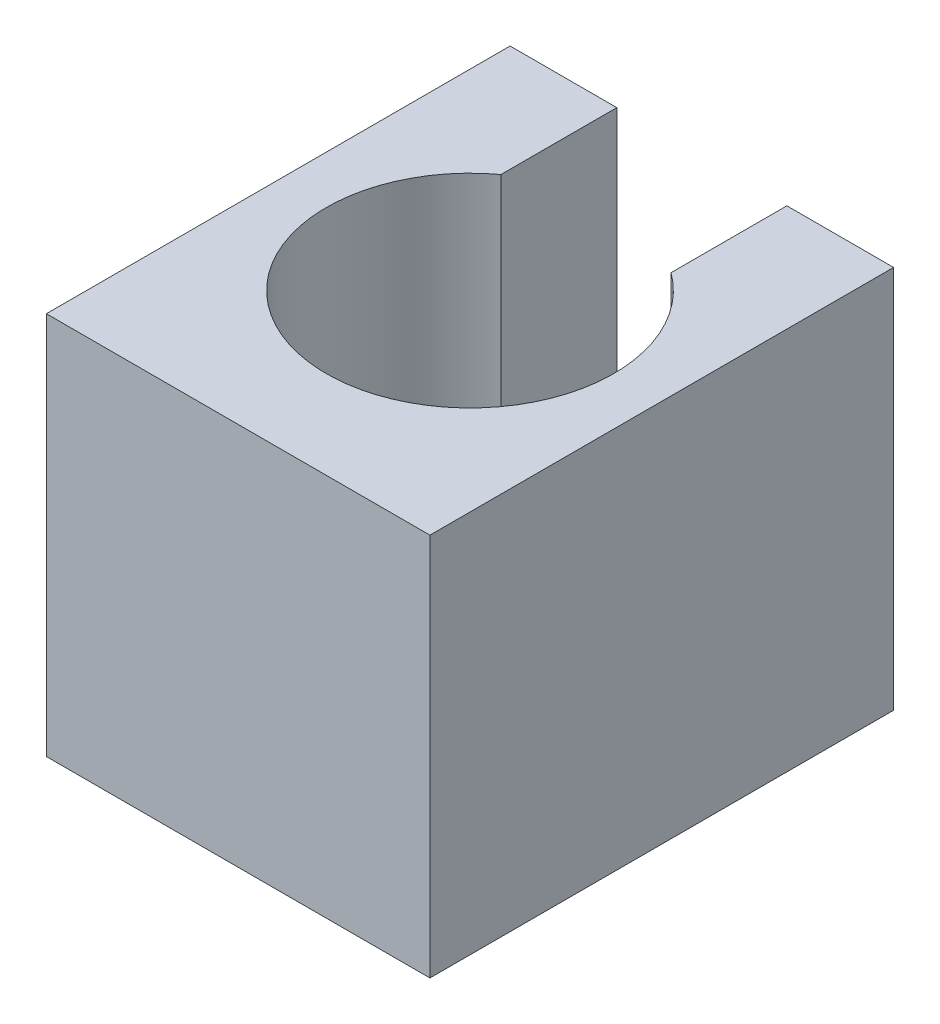
ISO-10303-21;
HEADER;
FILE_DESCRIPTION(('STEP AP214'),'2;1');
FILE_NAME('part.step','',(''),(''),'','','');
FILE_SCHEMA(('AUTOMOTIVE_DESIGN { 1 0 10303 214 1 1 1 1 }'));
ENDSEC;
DATA;
#1=APPLICATION_CONTEXT('core data for automotive mechanical design processes');
#2=APPLICATION_PROTOCOL_DEFINITION('international standard','automotive_design',2000,#1);
#3=PRODUCT_CONTEXT('',#1,'mechanical');
#4=PRODUCT('Part','Part','',(#3));
#5=PRODUCT_RELATED_PRODUCT_CATEGORY('part','',(#4));
#6=PRODUCT_DEFINITION_FORMATION('','',#4);
#7=PRODUCT_DEFINITION_CONTEXT('part definition',#1,'design');
#8=PRODUCT_DEFINITION('design','',#6,#7);
#9=PRODUCT_DEFINITION_SHAPE('','',#8);
#10=(LENGTH_UNIT() NAMED_UNIT(*) SI_UNIT(.MILLI.,.METRE.));
#11=(NAMED_UNIT(*) PLANE_ANGLE_UNIT() SI_UNIT($,.RADIAN.));
#12=(NAMED_UNIT(*) SI_UNIT($,.STERADIAN.) SOLID_ANGLE_UNIT());
#13=UNCERTAINTY_MEASURE_WITH_UNIT(LENGTH_MEASURE(1.E-05),#10,'distance_accuracy_value','');
#14=(GEOMETRIC_REPRESENTATION_CONTEXT(3) GLOBAL_UNCERTAINTY_ASSIGNED_CONTEXT((#13)) GLOBAL_UNIT_ASSIGNED_CONTEXT((#10,
#11,#12)) REPRESENTATION_CONTEXT('',''));
#15=CARTESIAN_POINT('',(0.,0.,0.));
#16=DIRECTION('',(0.,0.,1.));
#17=DIRECTION('',(1.,0.,0.));
#18=AXIS2_PLACEMENT_3D('',#15,#16,#17);
#19=CARTESIAN_POINT('',(3.,6.,-3.62704662847209));
#20=DIRECTION('',(-1.,0.,0.));
#21=DIRECTION('',(0.,0.,1.));
#22=AXIS2_PLACEMENT_3D('',#19,#20,#21);
#23=PLANE('',#22);
#24=DIRECTION('',(0.,0.,-1.));
#25=VECTOR('',#24,1.);
#26=CARTESIAN_POINT('',(3.,0.,-3.62704662847209));
#27=LINE('',#26,#25);
#28=CARTESIAN_POINT('',(3.,0.,3.62704662847209));
#29=VERTEX_POINT('',#28);
#30=CARTESIAN_POINT('',(3.,0.,-3.62704662847209));
#31=VERTEX_POINT('',#30);
#32=EDGE_CURVE('E131',#29,#31,#27,.T.);
#33=ORIENTED_EDGE('',*,*,#32,.T.);
#34=DIRECTION('',(0.,-1.,0.));
#35=VECTOR('',#34,1.);
#36=CARTESIAN_POINT('',(3.,6.,-3.62704662847209));
#37=LINE('',#36,#35);
#38=CARTESIAN_POINT('',(3.,6.,-3.62704662847209));
#39=VERTEX_POINT('',#38);
#40=EDGE_CURVE('E11',#39,#31,#37,.T.);
#41=ORIENTED_EDGE('',*,*,#40,.F.);
#42=DIRECTION('',(0.,0.,-1.));
#43=VECTOR('',#42,1.);
#44=CARTESIAN_POINT('',(3.,6.,-3.62704662847209));
#45=LINE('',#44,#43);
#46=CARTESIAN_POINT('',(3.,6.,3.62704662847209));
#47=VERTEX_POINT('',#46);
#48=EDGE_CURVE('E145',#47,#39,#45,.T.);
#49=ORIENTED_EDGE('',*,*,#48,.F.);
#50=DIRECTION('',(0.,-1.,0.));
#51=VECTOR('',#50,1.);
#52=CARTESIAN_POINT('',(3.,6.,3.62704662847209));
#53=LINE('',#52,#51);
#54=EDGE_CURVE('E127',#47,#29,#53,.T.);
#55=ORIENTED_EDGE('',*,*,#54,.T.);
#56=EDGE_LOOP('',(#33,#41,#49,#55));
#57=FACE_BOUND('',#56,.T.);
#58=ADVANCED_FACE('F35',(#57),#23,.F.);
#59=CARTESIAN_POINT('',(1.33027332112443,6.,-3.62704662847209));
#60=DIRECTION('',(0.,0.,1.));
#61=DIRECTION('',(1.,0.,0.));
#62=AXIS2_PLACEMENT_3D('',#59,#60,#61);
#63=PLANE('',#62);
#64=DIRECTION('',(-1.,0.,0.));
#65=VECTOR('',#64,1.);
#66=CARTESIAN_POINT('',(1.33027332112443,0.,-3.62704662847209));
#67=LINE('',#66,#65);
#68=CARTESIAN_POINT('',(1.33027332112443,0.,-3.62704662847209));
#69=VERTEX_POINT('',#68);
#70=EDGE_CURVE('E134',#31,#69,#67,.T.);
#71=ORIENTED_EDGE('',*,*,#70,.T.);
#72=DIRECTION('',(0.,-1.,0.));
#73=VECTOR('',#72,1.);
#74=CARTESIAN_POINT('',(1.33027332112443,6.,-3.62704662847209));
#75=LINE('',#74,#73);
#76=CARTESIAN_POINT('',(1.33027332112443,6.,-3.62704662847209));
#77=VERTEX_POINT('',#76);
#78=EDGE_CURVE('E43',#77,#69,#75,.T.);
#79=ORIENTED_EDGE('',*,*,#78,.F.);
#80=DIRECTION('',(-1.,0.,0.));
#81=VECTOR('',#80,1.);
#82=CARTESIAN_POINT('',(1.33027332112443,6.,-3.62704662847209));
#83=LINE('',#82,#81);
#84=EDGE_CURVE('E94',#39,#77,#83,.T.);
#85=ORIENTED_EDGE('',*,*,#84,.F.);
#86=ORIENTED_EDGE('',*,*,#40,.T.);
#87=EDGE_LOOP('',(#71,#79,#85,#86));
#88=FACE_BOUND('',#87,.T.);
#89=ADVANCED_FACE('F180',(#88),#63,.F.);
#90=CARTESIAN_POINT('',(1.33027332112443,6.,-3.62704662847209));
#91=DIRECTION('',(1.,0.,0.));
#92=DIRECTION('',(0.,0.,-1.));
#93=AXIS2_PLACEMENT_3D('',#90,#91,#92);
#94=PLANE('',#93);
#95=DIRECTION('',(0.,0.,1.));
#96=VECTOR('',#95,1.);
#97=CARTESIAN_POINT('',(1.33027332112443,0.,-3.62704662847209));
#98=LINE('',#97,#96);
#99=CARTESIAN_POINT('',(1.33027332112443,0.,-1.81462747998166));
#100=VERTEX_POINT('',#99);
#101=EDGE_CURVE('E136',#69,#100,#98,.T.);
#102=ORIENTED_EDGE('',*,*,#101,.T.);
#103=DIRECTION('',(0.,-1.,0.));
#104=VECTOR('',#103,1.);
#105=CARTESIAN_POINT('',(1.33027332112443,6.,-1.81462747998166));
#106=LINE('',#105,#104);
#107=CARTESIAN_POINT('',(1.33027332112443,6.,-1.81462747998166));
#108=VERTEX_POINT('',#107);
#109=EDGE_CURVE('E152',#108,#100,#106,.T.);
#110=ORIENTED_EDGE('',*,*,#109,.F.);
#111=DIRECTION('',(0.,0.,1.));
#112=VECTOR('',#111,1.);
#113=CARTESIAN_POINT('',(1.33027332112443,6.,-3.62704662847209));
#114=LINE('',#113,#112);
#115=EDGE_CURVE('E160',#77,#108,#114,.T.);
#116=ORIENTED_EDGE('',*,*,#115,.F.);
#117=ORIENTED_EDGE('',*,*,#78,.T.);
#118=EDGE_LOOP('',(#102,#110,#116,#117));
#119=FACE_BOUND('',#118,.T.);
#120=ADVANCED_FACE('F158',(#119),#94,.F.);
#121=CARTESIAN_POINT('',(0.,6.,0.));
#122=DIRECTION('',(0.,-1.,0.));
#123=DIRECTION('',(0.,0.,-1.));
#124=AXIS2_PLACEMENT_3D('',#121,#122,#123);
#125=CYLINDRICAL_SURFACE('',#124,2.25);
#126=CARTESIAN_POINT('',(0.,0.,0.));
#127=DIRECTION('',(0.,-1.,0.));
#128=DIRECTION('',(0.,0.,1.));
#129=AXIS2_PLACEMENT_3D('',#126,#127,#128);
#130=CIRCLE('',#129,2.25);
#131=CARTESIAN_POINT('',(-1.33027332112443,0.,-1.81462747998166));
#132=VERTEX_POINT('',#131);
#133=EDGE_CURVE('E138',#100,#132,#130,.T.);
#134=ORIENTED_EDGE('',*,*,#133,.T.);
#135=DIRECTION('',(0.,-1.,0.));
#136=VECTOR('',#135,1.);
#137=CARTESIAN_POINT('',(-1.33027332112443,6.,-1.81462747998166));
#138=LINE('',#137,#136);
#139=CARTESIAN_POINT('',(-1.33027332112443,6.,-1.81462747998166));
#140=VERTEX_POINT('',#139);
#141=EDGE_CURVE('E149',#140,#132,#138,.T.);
#142=ORIENTED_EDGE('',*,*,#141,.F.);
#143=CARTESIAN_POINT('',(0.,6.,0.));
#144=DIRECTION('',(0.,-1.,0.));
#145=DIRECTION('',(0.,0.,1.));
#146=AXIS2_PLACEMENT_3D('',#143,#144,#145);
#147=CIRCLE('',#146,2.25);
#148=EDGE_CURVE('E172',#108,#140,#147,.T.);
#149=ORIENTED_EDGE('',*,*,#148,.F.);
#150=ORIENTED_EDGE('',*,*,#109,.T.);
#151=EDGE_LOOP('',(#134,#142,#149,#150));
#152=FACE_BOUND('',#151,.T.);
#153=ADVANCED_FACE('F168',(#152),#125,.F.);
#154=CARTESIAN_POINT('',(-1.33027332112443,6.,-3.62704662847209));
#155=DIRECTION('',(-1.,0.,0.));
#156=DIRECTION('',(0.,0.,1.));
#157=AXIS2_PLACEMENT_3D('',#154,#155,#156);
#158=PLANE('',#157);
#159=DIRECTION('',(0.,0.,-1.));
#160=VECTOR('',#159,1.);
#161=CARTESIAN_POINT('',(-1.33027332112443,0.,-3.62704662847209));
#162=LINE('',#161,#160);
#163=CARTESIAN_POINT('',(-1.33027332112443,0.,-3.62704662847209));
#164=VERTEX_POINT('',#163);
#165=EDGE_CURVE('E140',#132,#164,#162,.T.);
#166=ORIENTED_EDGE('',*,*,#165,.T.);
#167=DIRECTION('',(0.,-1.,0.));
#168=VECTOR('',#167,1.);
#169=CARTESIAN_POINT('',(-1.33027332112443,6.,-3.62704662847209));
#170=LINE('',#169,#168);
#171=CARTESIAN_POINT('',(-1.33027332112443,6.,-3.62704662847209));
#172=VERTEX_POINT('',#171);
#173=EDGE_CURVE('E122',#172,#164,#170,.T.);
#174=ORIENTED_EDGE('',*,*,#173,.F.);
#175=DIRECTION('',(0.,0.,-1.));
#176=VECTOR('',#175,1.);
#177=CARTESIAN_POINT('',(-1.33027332112443,6.,-3.62704662847209));
#178=LINE('',#177,#176);
#179=EDGE_CURVE('E113',#140,#172,#178,.T.);
#180=ORIENTED_EDGE('',*,*,#179,.F.);
#181=ORIENTED_EDGE('',*,*,#141,.T.);
#182=EDGE_LOOP('',(#166,#174,#180,#181));
#183=FACE_BOUND('',#182,.T.);
#184=ADVANCED_FACE('F171',(#183),#158,.F.);
#185=CARTESIAN_POINT('',(-3.,6.,-3.62704662847209));
#186=DIRECTION('',(0.,0.,1.));
#187=DIRECTION('',(1.,0.,0.));
#188=AXIS2_PLACEMENT_3D('',#185,#186,#187);
#189=PLANE('',#188);
#190=DIRECTION('',(-1.,0.,0.));
#191=VECTOR('',#190,1.);
#192=CARTESIAN_POINT('',(-3.,0.,-3.62704662847209));
#193=LINE('',#192,#191);
#194=CARTESIAN_POINT('',(-3.,0.,-3.62704662847209));
#195=VERTEX_POINT('',#194);
#196=EDGE_CURVE('E121',#164,#195,#193,.T.);
#197=ORIENTED_EDGE('',*,*,#196,.T.);
#198=DIRECTION('',(0.,-1.,0.));
#199=VECTOR('',#198,1.);
#200=CARTESIAN_POINT('',(-3.,6.,-3.62704662847209));
#201=LINE('',#200,#199);
#202=CARTESIAN_POINT('',(-3.,6.,-3.62704662847209));
#203=VERTEX_POINT('',#202);
#204=EDGE_CURVE('E118',#203,#195,#201,.T.);
#205=ORIENTED_EDGE('',*,*,#204,.F.);
#206=DIRECTION('',(-1.,0.,0.));
#207=VECTOR('',#206,1.);
#208=CARTESIAN_POINT('',(-3.,6.,-3.62704662847209));
#209=LINE('',#208,#207);
#210=EDGE_CURVE('E107',#172,#203,#209,.T.);
#211=ORIENTED_EDGE('',*,*,#210,.F.);
#212=ORIENTED_EDGE('',*,*,#173,.T.);
#213=EDGE_LOOP('',(#197,#205,#211,#212));
#214=FACE_BOUND('',#213,.T.);
#215=ADVANCED_FACE('F119',(#214),#189,.F.);
#216=CARTESIAN_POINT('',(-3.,6.,-3.62704662847209));
#217=DIRECTION('',(1.,0.,0.));
#218=DIRECTION('',(0.,0.,-1.));
#219=AXIS2_PLACEMENT_3D('',#216,#217,#218);
#220=PLANE('',#219);
#221=DIRECTION('',(0.,0.,1.));
#222=VECTOR('',#221,1.);
#223=CARTESIAN_POINT('',(-3.,0.,-3.62704662847209));
#224=LINE('',#223,#222);
#225=CARTESIAN_POINT('',(-3.,0.,3.62704662847209));
#226=VERTEX_POINT('',#225);
#227=EDGE_CURVE('E80',#195,#226,#224,.T.);
#228=ORIENTED_EDGE('',*,*,#227,.T.);
#229=DIRECTION('',(0.,-1.,0.));
#230=VECTOR('',#229,1.);
#231=CARTESIAN_POINT('',(-3.,6.,3.62704662847209));
#232=LINE('',#231,#230);
#233=CARTESIAN_POINT('',(-3.,6.,3.62704662847209));
#234=VERTEX_POINT('',#233);
#235=EDGE_CURVE('E123',#234,#226,#232,.T.);
#236=ORIENTED_EDGE('',*,*,#235,.F.);
#237=DIRECTION('',(0.,0.,1.));
#238=VECTOR('',#237,1.);
#239=CARTESIAN_POINT('',(-3.,6.,-3.62704662847209));
#240=LINE('',#239,#238);
#241=EDGE_CURVE('E111',#203,#234,#240,.T.);
#242=ORIENTED_EDGE('',*,*,#241,.F.);
#243=ORIENTED_EDGE('',*,*,#204,.T.);
#244=EDGE_LOOP('',(#228,#236,#242,#243));
#245=FACE_BOUND('',#244,.T.);
#246=ADVANCED_FACE('F125',(#245),#220,.F.);
#247=CARTESIAN_POINT('',(-3.,6.,3.62704662847209));
#248=DIRECTION('',(0.,0.,-1.));
#249=DIRECTION('',(-1.,0.,0.));
#250=AXIS2_PLACEMENT_3D('',#247,#248,#249);
#251=PLANE('',#250);
#252=DIRECTION('',(1.,0.,0.));
#253=VECTOR('',#252,1.);
#254=CARTESIAN_POINT('',(-3.,0.,3.62704662847209));
#255=LINE('',#254,#253);
#256=EDGE_CURVE('E86',#226,#29,#255,.T.);
#257=ORIENTED_EDGE('',*,*,#256,.T.);
#258=ORIENTED_EDGE('',*,*,#54,.F.);
#259=DIRECTION('',(1.,0.,0.));
#260=VECTOR('',#259,1.);
#261=CARTESIAN_POINT('',(-3.,6.,3.62704662847209));
#262=LINE('',#261,#260);
#263=EDGE_CURVE('E51',#234,#47,#262,.T.);
#264=ORIENTED_EDGE('',*,*,#263,.F.);
#265=ORIENTED_EDGE('',*,*,#235,.T.);
#266=EDGE_LOOP('',(#257,#258,#264,#265));
#267=FACE_BOUND('',#266,.T.);
#268=ADVANCED_FACE('F196',(#267),#251,.F.);
#269=CARTESIAN_POINT('',(0.,6.,0.));
#270=DIRECTION('',(0.,1.,0.));
#271=DIRECTION('',(0.,0.,1.));
#272=AXIS2_PLACEMENT_3D('',#269,#270,#271);
#273=PLANE('',#272);
#274=ORIENTED_EDGE('',*,*,#48,.T.);
#275=ORIENTED_EDGE('',*,*,#84,.T.);
#276=ORIENTED_EDGE('',*,*,#115,.T.);
#277=ORIENTED_EDGE('',*,*,#148,.T.);
#278=ORIENTED_EDGE('',*,*,#179,.T.);
#279=ORIENTED_EDGE('',*,*,#210,.T.);
#280=ORIENTED_EDGE('',*,*,#241,.T.);
#281=ORIENTED_EDGE('',*,*,#263,.T.);
#282=EDGE_LOOP('',(#274,#275,#276,#277,#278,#279,#280,#281));
#283=FACE_BOUND('',#282,.T.);
#284=ADVANCED_FACE('F109',(#283),#273,.T.);
#285=CARTESIAN_POINT('',(0.,0.,0.));
#286=DIRECTION('',(0.,1.,0.));
#287=DIRECTION('',(0.,0.,1.));
#288=AXIS2_PLACEMENT_3D('',#285,#286,#287);
#289=PLANE('',#288);
#290=ORIENTED_EDGE('',*,*,#32,.F.);
#291=ORIENTED_EDGE('',*,*,#256,.F.);
#292=ORIENTED_EDGE('',*,*,#227,.F.);
#293=ORIENTED_EDGE('',*,*,#196,.F.);
#294=ORIENTED_EDGE('',*,*,#165,.F.);
#295=ORIENTED_EDGE('',*,*,#133,.F.);
#296=ORIENTED_EDGE('',*,*,#101,.F.);
#297=ORIENTED_EDGE('',*,*,#70,.F.);
#298=EDGE_LOOP('',(#290,#291,#292,#293,#294,#295,#296,#297));
#299=FACE_BOUND('',#298,.T.);
#300=ADVANCED_FACE('F164',(#299),#289,.F.);
#301=CLOSED_SHELL('',(#58,#89,#120,#153,#184,#215,#246,#268,#284,#300));
#302=MANIFOLD_SOLID_BREP('B2',#301);
#303=ADVANCED_BREP_SHAPE_REPRESENTATION('',(#18,#302),#14);
#304=SHAPE_DEFINITION_REPRESENTATION(#9,#303);
ENDSEC;
END-ISO-10303-21;
